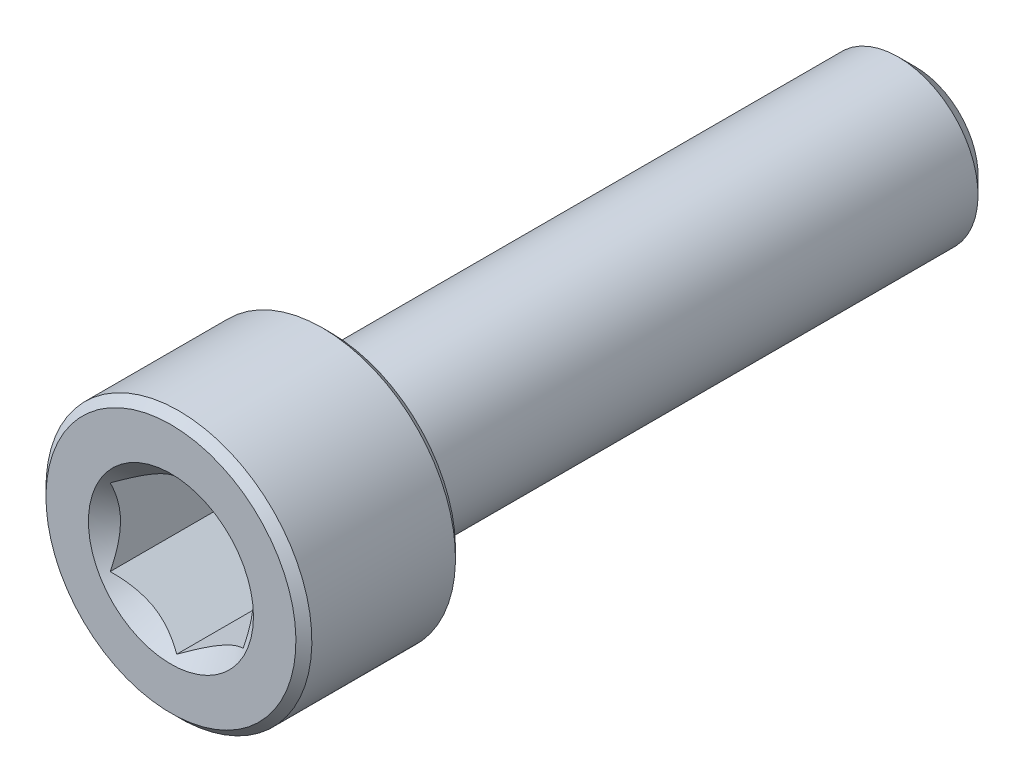
ISO-10303-21;
HEADER;
FILE_DESCRIPTION(('STEP AP214'),'2;1');
FILE_NAME('part.step','',(''),(''),'','','');
FILE_SCHEMA(('AUTOMOTIVE_DESIGN { 1 0 10303 214 1 1 1 1 }'));
ENDSEC;
DATA;
#1=APPLICATION_CONTEXT('core data for automotive mechanical design processes');
#2=APPLICATION_PROTOCOL_DEFINITION('international standard','automotive_design',2000,#1);
#3=PRODUCT_CONTEXT('',#1,'mechanical');
#4=PRODUCT('Part','Part','',(#3));
#5=PRODUCT_RELATED_PRODUCT_CATEGORY('part','',(#4));
#6=PRODUCT_DEFINITION_FORMATION('','',#4);
#7=PRODUCT_DEFINITION_CONTEXT('part definition',#1,'design');
#8=PRODUCT_DEFINITION('design','',#6,#7);
#9=PRODUCT_DEFINITION_SHAPE('','',#8);
#10=(LENGTH_UNIT() NAMED_UNIT(*) SI_UNIT(.MILLI.,.METRE.));
#11=(NAMED_UNIT(*) PLANE_ANGLE_UNIT() SI_UNIT($,.RADIAN.));
#12=(NAMED_UNIT(*) SI_UNIT($,.STERADIAN.) SOLID_ANGLE_UNIT());
#13=UNCERTAINTY_MEASURE_WITH_UNIT(LENGTH_MEASURE(1.E-05),#10,'distance_accuracy_value','');
#14=(GEOMETRIC_REPRESENTATION_CONTEXT(3) GLOBAL_UNCERTAINTY_ASSIGNED_CONTEXT((#13)) GLOBAL_UNIT_ASSIGNED_CONTEXT((#10,
#11,#12)) REPRESENTATION_CONTEXT('',''));
#15=CARTESIAN_POINT('',(0.,0.,0.));
#16=DIRECTION('',(0.,0.,1.));
#17=DIRECTION('',(1.,0.,0.));
#18=AXIS2_PLACEMENT_3D('',#15,#16,#17);
#19=CARTESIAN_POINT('',(0.,2.35048094716167,-14.));
#20=DIRECTION('',(0.,0.,-1.));
#21=DIRECTION('',(0.,1.,0.));
#22=AXIS2_PLACEMENT_3D('',#19,#20,#21);
#23=PLANE('',#22);
#24=CARTESIAN_POINT('',(0.,0.,-14.));
#25=DIRECTION('',(0.,0.,-1.));
#26=DIRECTION('',(0.,1.,0.));
#27=AXIS2_PLACEMENT_3D('',#24,#25,#26);
#28=CIRCLE('',#27,2.35048094716167);
#29=CARTESIAN_POINT('',(0.,2.35048094716167,-14.));
#30=VERTEX_POINT('',#29);
#31=EDGE_CURVE('E57',#30,#30,#28,.T.);
#32=ORIENTED_EDGE('',*,*,#31,.T.);
#33=EDGE_LOOP('',(#32));
#34=FACE_BOUND('',#33,.T.);
#35=ADVANCED_FACE('F43',(#34),#23,.T.);
#36=CARTESIAN_POINT('',(0.,0.,-14.));
#37=DIRECTION('',(0.,0.,1.));
#38=DIRECTION('',(0.,-1.,0.));
#39=AXIS2_PLACEMENT_3D('',#36,#37,#38);
#40=CONICAL_SURFACE('',#39,2.35048094716167,0.785398163397445);
#41=CARTESIAN_POINT('',(0.,0.,-13.3504809471617));
#42=DIRECTION('',(0.,0.,-1.));
#43=DIRECTION('',(0.,1.,0.));
#44=AXIS2_PLACEMENT_3D('',#41,#42,#43);
#45=CIRCLE('',#44,3.);
#46=CARTESIAN_POINT('',(0.,3.,-13.3504809471617));
#47=VERTEX_POINT('',#46);
#48=EDGE_CURVE('E175',#47,#47,#45,.T.);
#49=ORIENTED_EDGE('',*,*,#48,.T.);
#50=EDGE_LOOP('',(#49));
#51=FACE_BOUND('',#50,.T.);
#52=ORIENTED_EDGE('',*,*,#31,.F.);
#53=EDGE_LOOP('',(#52));
#54=FACE_BOUND('',#53,.T.);
#55=ADVANCED_FACE('F183',(#51,#54),#40,.T.);
#56=CARTESIAN_POINT('',(0.,0.,-14.));
#57=DIRECTION('',(0.,0.,-1.));
#58=DIRECTION('',(0.,1.,0.));
#59=AXIS2_PLACEMENT_3D('',#56,#57,#58);
#60=CYLINDRICAL_SURFACE('',#59,3.);
#61=CARTESIAN_POINT('',(0.,0.,7.7));
#62=DIRECTION('',(0.,0.,-1.));
#63=DIRECTION('',(0.,1.,0.));
#64=AXIS2_PLACEMENT_3D('',#61,#62,#63);
#65=CIRCLE('',#64,3.);
#66=CARTESIAN_POINT('',(0.,3.,7.7));
#67=VERTEX_POINT('',#66);
#68=EDGE_CURVE('E171',#67,#67,#65,.T.);
#69=ORIENTED_EDGE('',*,*,#68,.T.);
#70=EDGE_LOOP('',(#69));
#71=FACE_BOUND('',#70,.T.);
#72=ORIENTED_EDGE('',*,*,#48,.F.);
#73=EDGE_LOOP('',(#72));
#74=FACE_BOUND('',#73,.T.);
#75=ADVANCED_FACE('F185',(#71,#74),#60,.T.);
#76=CARTESIAN_POINT('',(0.,0.,7.7));
#77=DIRECTION('',(0.,0.,-1.));
#78=DIRECTION('',(0.,1.,0.));
#79=AXIS2_PLACEMENT_3D('',#76,#77,#78);
#80=TOROIDAL_SURFACE('',#79,3.3,0.3);
#81=CARTESIAN_POINT('',(0.,0.,8.));
#82=DIRECTION('',(0.,0.,-1.));
#83=DIRECTION('',(0.,1.,0.));
#84=AXIS2_PLACEMENT_3D('',#81,#82,#83);
#85=CIRCLE('',#84,3.3);
#86=CARTESIAN_POINT('',(0.,3.3,8.));
#87=VERTEX_POINT('',#86);
#88=EDGE_CURVE('E167',#87,#87,#85,.T.);
#89=ORIENTED_EDGE('',*,*,#88,.T.);
#90=EDGE_LOOP('',(#89));
#91=FACE_BOUND('',#90,.T.);
#92=ORIENTED_EDGE('',*,*,#68,.F.);
#93=EDGE_LOOP('',(#92));
#94=FACE_BOUND('',#93,.T.);
#95=ADVANCED_FACE('F191',(#91,#94),#80,.F.);
#96=CARTESIAN_POINT('',(0.,4.7,8.));
#97=DIRECTION('',(0.,0.,-1.));
#98=DIRECTION('',(0.,1.,0.));
#99=AXIS2_PLACEMENT_3D('',#96,#97,#98);
#100=PLANE('',#99);
#101=CARTESIAN_POINT('',(0.,0.,8.));
#102=DIRECTION('',(0.,0.,-1.));
#103=DIRECTION('',(0.,1.,0.));
#104=AXIS2_PLACEMENT_3D('',#101,#102,#103);
#105=CIRCLE('',#104,4.7);
#106=CARTESIAN_POINT('',(0.,4.7,8.));
#107=VERTEX_POINT('',#106);
#108=EDGE_CURVE('E163',#107,#107,#105,.T.);
#109=ORIENTED_EDGE('',*,*,#108,.T.);
#110=EDGE_LOOP('',(#109));
#111=FACE_BOUND('',#110,.T.);
#112=ORIENTED_EDGE('',*,*,#88,.F.);
#113=EDGE_LOOP('',(#112));
#114=FACE_BOUND('',#113,.T.);
#115=ADVANCED_FACE('F197',(#111,#114),#100,.T.);
#116=CARTESIAN_POINT('',(0.,0.,8.));
#117=DIRECTION('',(0.,0.,1.));
#118=DIRECTION('',(0.,-1.,0.));
#119=AXIS2_PLACEMENT_3D('',#116,#117,#118);
#120=CONICAL_SURFACE('',#119,4.7,0.785398163397445);
#121=CARTESIAN_POINT('',(0.,0.,8.3));
#122=DIRECTION('',(0.,0.,-1.));
#123=DIRECTION('',(0.,1.,0.));
#124=AXIS2_PLACEMENT_3D('',#121,#122,#123);
#125=CIRCLE('',#124,5.);
#126=CARTESIAN_POINT('',(0.,5.,8.3));
#127=VERTEX_POINT('',#126);
#128=EDGE_CURVE('E159',#127,#127,#125,.T.);
#129=ORIENTED_EDGE('',*,*,#128,.T.);
#130=EDGE_LOOP('',(#129));
#131=FACE_BOUND('',#130,.T.);
#132=ORIENTED_EDGE('',*,*,#108,.F.);
#133=EDGE_LOOP('',(#132));
#134=FACE_BOUND('',#133,.T.);
#135=ADVANCED_FACE('F201',(#131,#134),#120,.T.);
#136=CARTESIAN_POINT('',(0.,0.,-14.));
#137=DIRECTION('',(0.,0.,-1.));
#138=DIRECTION('',(0.,1.,0.));
#139=AXIS2_PLACEMENT_3D('',#136,#137,#138);
#140=CYLINDRICAL_SURFACE('',#139,5.);
#141=CARTESIAN_POINT('',(0.,0.,13.7));
#142=DIRECTION('',(0.,0.,-1.));
#143=DIRECTION('',(0.,1.,0.));
#144=AXIS2_PLACEMENT_3D('',#141,#142,#143);
#145=CIRCLE('',#144,5.);
#146=CARTESIAN_POINT('',(0.,5.,13.7));
#147=VERTEX_POINT('',#146);
#148=EDGE_CURVE('E155',#147,#147,#145,.T.);
#149=ORIENTED_EDGE('',*,*,#148,.T.);
#150=EDGE_LOOP('',(#149));
#151=FACE_BOUND('',#150,.T.);
#152=ORIENTED_EDGE('',*,*,#128,.F.);
#153=EDGE_LOOP('',(#152));
#154=FACE_BOUND('',#153,.T.);
#155=ADVANCED_FACE('F205',(#151,#154),#140,.T.);
#156=CARTESIAN_POINT('',(0.,0.,13.7));
#157=DIRECTION('',(0.,0.,-1.));
#158=DIRECTION('',(0.,1.,0.));
#159=AXIS2_PLACEMENT_3D('',#156,#157,#158);
#160=CONICAL_SURFACE('',#159,5.,0.785398163397451);
#161=CARTESIAN_POINT('',(0.,0.,14.));
#162=DIRECTION('',(0.,0.,-1.));
#163=DIRECTION('',(0.,1.,0.));
#164=AXIS2_PLACEMENT_3D('',#161,#162,#163);
#165=CIRCLE('',#164,4.7);
#166=CARTESIAN_POINT('',(0.,4.7,14.));
#167=VERTEX_POINT('',#166);
#168=EDGE_CURVE('E151',#167,#167,#165,.T.);
#169=ORIENTED_EDGE('',*,*,#168,.T.);
#170=EDGE_LOOP('',(#169));
#171=FACE_BOUND('',#170,.T.);
#172=ORIENTED_EDGE('',*,*,#148,.F.);
#173=EDGE_LOOP('',(#172));
#174=FACE_BOUND('',#173,.T.);
#175=ADVANCED_FACE('F209',(#171,#174),#160,.T.);
#176=CARTESIAN_POINT('',(0.,0.,14.));
#177=DIRECTION('',(0.,0.,1.));
#178=DIRECTION('',(0.,-1.,0.));
#179=AXIS2_PLACEMENT_3D('',#176,#177,#178);
#180=PLANE('',#179);
#181=CARTESIAN_POINT('',(0.,0.,14.));
#182=DIRECTION('',(0.,0.,1.));
#183=DIRECTION('',(1.,0.,0.));
#184=AXIS2_PLACEMENT_3D('',#181,#182,#183);
#185=CIRCLE('',#184,3.10325769689424);
#186=CARTESIAN_POINT('',(3.10325769689424,0.,14.));
#187=VERTEX_POINT('',#186);
#188=EDGE_CURVE('E117',#187,#187,#185,.T.);
#189=ORIENTED_EDGE('',*,*,#188,.F.);
#190=EDGE_LOOP('',(#189));
#191=FACE_BOUND('',#190,.T.);
#192=ORIENTED_EDGE('',*,*,#168,.F.);
#193=EDGE_LOOP('',(#192));
#194=FACE_BOUND('',#193,.T.);
#195=ADVANCED_FACE('F213',(#191,#194),#180,.T.);
#196=CARTESIAN_POINT('',(0.,0.,14.));
#197=DIRECTION('',(0.,0.,1.));
#198=DIRECTION('',(1.,0.,0.));
#199=AXIS2_PLACEMENT_3D('',#196,#197,#198);
#200=CONICAL_SURFACE('',#199,3.10325769689424,0.78539816339745);
#201=ORIENTED_EDGE('',*,*,#188,.T.);
#202=EDGE_LOOP('',(#201));
#203=FACE_BOUND('',#202,.T.);
#204=CARTESIAN_POINT('',(-0.000199999999999129,-2.88686681600197,13.7836091260357));
#205=CARTESIAN_POINT('',(0.0857382777877655,-2.83725032818751,13.7340343544086));
#206=CARTESIAN_POINT('',(0.173113567275754,-2.7868041812811,13.6873711304164));
#207=CARTESIAN_POINT('',(0.351281456165589,-2.6839389026696,13.6019317890922));
#208=CARTESIAN_POINT('',(0.442091000681076,-2.6315099876986,13.5632032114599));
#209=CARTESIAN_POINT('',(0.625204123126922,-2.52578957716234,13.4968603529516));
#210=CARTESIAN_POINT('',(0.717461064529342,-2.47252500720904,13.4690793175847));
#211=CARTESIAN_POINT('',(0.904006008776288,-2.3648232334321,13.4262768249646));
#212=CARTESIAN_POINT('',(0.998288312566285,-2.31038931995913,13.4112234157252));
#213=CARTESIAN_POINT('',(1.16077825829185,-2.21657570605387,13.3976413712634));
#214=CARTESIAN_POINT('',(1.22877596788015,-2.17731721011878,13.3956307482947));
#215=CARTESIAN_POINT('',(1.36466024116922,-2.0988643883567,13.3990177662414));
#216=CARTESIAN_POINT('',(1.43254675755224,-2.05967008984862,13.4044180043537));
#217=CARTESIAN_POINT('',(1.56767878823611,-1.98165157555715,13.4223194374564));
#218=CARTESIAN_POINT('',(1.63492349975356,-1.94282782326097,13.4348285761004));
#219=CARTESIAN_POINT('',(1.7682501008182,-1.86585167424616,13.4662611510096));
#220=CARTESIAN_POINT('',(1.83433207909966,-1.82769922629678,13.4851840955507));
#221=CARTESIAN_POINT('',(2.00359634669127,-1.72997445583858,13.5413610104621));
#222=CARTESIAN_POINT('',(2.10572912222289,-1.67100807039231,13.5828494806501));
#223=CARTESIAN_POINT('',(2.25590641494051,-1.58430317001562,13.652887695777));
#224=CARTESIAN_POINT('',(2.30539653988261,-1.55573003305807,13.67749590117));
#225=CARTESIAN_POINT('',(2.40346006383885,-1.49911303110426,13.7289555357691));
#226=CARTESIAN_POINT('',(2.45203400349693,-1.47106885396706,13.7558055878332));
#227=CARTESIAN_POINT('',(2.5002,-1.44326020292023,13.7836091260357));
#228=B_SPLINE_CURVE_WITH_KNOTS('',3,(#204,#205,#206,#207,#208,#209,#210,#211,#212,#213,#214,
#215,#216,#217,#218,#219,#220,#221,#222,#223,#224,#225,#226,#227),.UNSPECIFIED.,.F.,.F.,(4,2,2,
2,2,2,2,2,2,2,2,4),(0.,0.333012085133924,0.667964518301397,0.997597032043301,1.32639954393844,
1.56169424147169,1.79707142102083,2.03271213522171,2.26833478775651,2.64260240809533,
2.82922877818864,3.01574133749025),.UNSPECIFIED.);
#229=CARTESIAN_POINT('',(0.,-2.88675134594813,13.7834936490539));
#230=VERTEX_POINT('',#229);
#231=CARTESIAN_POINT('',(2.5,-1.44337567297406,13.7834936490539));
#232=VERTEX_POINT('',#231);
#233=EDGE_CURVE('E12',#230,#232,#228,.T.);
#234=ORIENTED_EDGE('',*,*,#233,.F.);
#235=CARTESIAN_POINT('',(-2.5002,-1.44326020292023,13.7836091260357));
#236=CARTESIAN_POINT('',(-2.41426172221224,-1.49287669073469,13.7340343544086));
#237=CARTESIAN_POINT('',(-2.32688643272425,-1.5433228376411,13.6873711304164));
#238=CARTESIAN_POINT('',(-2.14871854383441,-1.64618811625259,13.6019317890922));
#239=CARTESIAN_POINT('',(-2.05790899931893,-1.69861703122359,13.5632032114599));
#240=CARTESIAN_POINT('',(-1.87479587687308,-1.80433744175986,13.4968603529516));
#241=CARTESIAN_POINT('',(-1.78253893547066,-1.85760201171315,13.4690793175847));
#242=CARTESIAN_POINT('',(-1.59599399122372,-1.96530378549009,13.4262768249646));
#243=CARTESIAN_POINT('',(-1.50171168743372,-2.01973769896307,13.4112234157252));
#244=CARTESIAN_POINT('',(-1.33922174170816,-2.11355131286833,13.3976413712634));
#245=CARTESIAN_POINT('',(-1.27122403211985,-2.15280980880341,13.3956307482947));
#246=CARTESIAN_POINT('',(-1.13533975883078,-2.23126263056549,13.3990177662414));
#247=CARTESIAN_POINT('',(-1.06745324244776,-2.27045692907358,13.4044180043537));
#248=CARTESIAN_POINT('',(-0.932321211763895,-2.34847544336505,13.4223194374564));
#249=CARTESIAN_POINT('',(-0.865076500246441,-2.38729919566123,13.4348285761004));
#250=CARTESIAN_POINT('',(-0.731749899181802,-2.46427534467604,13.4662611510096));
#251=CARTESIAN_POINT('',(-0.665667920900344,-2.50242779262542,13.4851840955507));
#252=CARTESIAN_POINT('',(-0.496403653308736,-2.60015256308362,13.5413610104621));
#253=CARTESIAN_POINT('',(-0.394270877777107,-2.65911894852989,13.5828494806501));
#254=CARTESIAN_POINT('',(-0.244093585059491,-2.74582384890657,13.652887695777));
#255=CARTESIAN_POINT('',(-0.194603460117391,-2.77439698586412,13.67749590117));
#256=CARTESIAN_POINT('',(-0.0965399361611526,-2.83101398781794,13.7289555357691));
#257=CARTESIAN_POINT('',(-0.0479659965030713,-2.85905816495513,13.7558055878332));
#258=CARTESIAN_POINT('',(0.000200000000000756,-2.88686681600197,13.7836091260357));
#259=B_SPLINE_CURVE_WITH_KNOTS('',3,(#235,#236,#237,#238,#239,#240,#241,#242,#243,#244,#245,
#246,#247,#248,#249,#250,#251,#252,#253,#254,#255,#256,#257,#258),.UNSPECIFIED.,.F.,.F.,(4,2,2,
2,2,2,2,2,2,2,2,4),(0.,0.333012085133923,0.667964518301396,0.997597032043298,1.32639954393844,
1.56169424147169,1.79707142102083,2.03271213522171,2.26833478775651,2.64260240809533,
2.82922877818864,3.01574133749025),.UNSPECIFIED.);
#260=CARTESIAN_POINT('',(-2.5,-1.44337567297407,13.7834936490539));
#261=VERTEX_POINT('',#260);
#262=EDGE_CURVE('E102',#261,#230,#259,.T.);
#263=ORIENTED_EDGE('',*,*,#262,.F.);
#264=CARTESIAN_POINT('',(-2.5,-3.0404429247869,14.8330214063817));
#265=CARTESIAN_POINT('',(-2.5,-2.96709478172557,14.7763788487171));
#266=CARTESIAN_POINT('',(-2.5,-2.89335465135762,14.7202359693275));
#267=CARTESIAN_POINT('',(-2.5,-2.74492905640712,14.6091787819783));
#268=CARTESIAN_POINT('',(-2.5,-2.67024337493575,14.5542647641906));
#269=CARTESIAN_POINT('',(-2.5,-2.51921990828825,14.4455038420407));
#270=CARTESIAN_POINT('',(-2.5,-2.44287382770906,14.391668419147));
#271=CARTESIAN_POINT('',(-2.5,-2.28891665120372,14.2858441602624));
#272=CARTESIAN_POINT('',(-2.5,-2.21130564250585,14.2338551977207));
#273=CARTESIAN_POINT('',(-2.5,-2.04951799142744,14.1288457042913));
#274=CARTESIAN_POINT('',(-2.5,-1.96524215656549,14.0759772332794));
#275=CARTESIAN_POINT('',(-2.5,-1.79473490703969,13.9734987026906));
#276=CARTESIAN_POINT('',(-2.5,-1.70850374831487,13.9238882199388));
#277=CARTESIAN_POINT('',(-2.5,-1.53401833929875,13.8289545270337));
#278=CARTESIAN_POINT('',(-2.5,-1.44577065756376,13.7836193384592));
#279=CARTESIAN_POINT('',(-2.5,-1.26676310994808,13.6982604224777));
#280=CARTESIAN_POINT('',(-2.5,-1.17600446376454,13.658234169168));
#281=CARTESIAN_POINT('',(-2.5,-1.00118351570532,13.5886962875671));
#282=CARTESIAN_POINT('',(-2.5,-0.917385051629537,13.5585280842829));
#283=CARTESIAN_POINT('',(-2.5,-0.747629060099932,13.5048969377877));
#284=CARTESIAN_POINT('',(-2.5,-0.661671397551605,13.4814344152734));
#285=CARTESIAN_POINT('',(-2.5,-0.489622081200868,13.4428857605003));
#286=CARTESIAN_POINT('',(-2.5,-0.40356552129825,13.4276456482725));
#287=CARTESIAN_POINT('',(-2.5,-0.230352389629818,13.4058639492467));
#288=CARTESIAN_POINT('',(-2.5,-0.143196059113861,13.3993204870893));
#289=CARTESIAN_POINT('',(-2.5,0.0273612295446632,13.395504167584));
#290=CARTESIAN_POINT('',(-2.5,0.110753131974797,13.3978241071313));
#291=CARTESIAN_POINT('',(-2.5,0.276898134935754,13.4106653349727));
#292=CARTESIAN_POINT('',(-2.5,0.359651177707743,13.421187356241));
#293=CARTESIAN_POINT('',(-2.5,0.525325927795181,13.4500114990314));
#294=CARTESIAN_POINT('',(-2.5,0.608223175291063,13.4684520406654));
#295=CARTESIAN_POINT('',(-2.5,0.772178834557464,13.5120846864152));
#296=CARTESIAN_POINT('',(-2.5,0.853237339741925,13.5372764467107));
#297=CARTESIAN_POINT('',(-2.5,1.10159689599554,13.6241193926927));
#298=CARTESIAN_POINT('',(-2.5,1.2655525401235,13.6953668377804));
#299=CARTESIAN_POINT('',(-2.5,1.50551769780196,13.8142345481021));
#300=CARTESIAN_POINT('',(-2.5,1.58465788064155,13.8559484521643));
#301=CARTESIAN_POINT('',(-2.5,1.74114816885994,13.9426161601922));
#302=CARTESIAN_POINT('',(-2.5,1.81849858456147,13.9875693968529));
#303=CARTESIAN_POINT('',(-2.5,1.96784059769267,14.0777853522682));
#304=CARTESIAN_POINT('',(-2.5,2.03990833441822,14.1229234485208));
#305=CARTESIAN_POINT('',(-2.5,2.18280709640722,14.2151257428437));
#306=CARTESIAN_POINT('',(-2.5,2.2536380285734,14.2621900850232));
#307=CARTESIAN_POINT('',(-2.5,2.39365462675841,14.3575181428367));
#308=CARTESIAN_POINT('',(-2.5,2.46284892785043,14.405769227967));
#309=CARTESIAN_POINT('',(-2.5,2.60028772768959,14.5035675953205));
#310=CARTESIAN_POINT('',(-2.5,2.66853248306037,14.5531145164816));
#311=CARTESIAN_POINT('',(-2.5,2.73637900498552,14.6031920948776));
#312=B_SPLINE_CURVE_WITH_KNOTS('',3,(#264,#265,#266,#267,#268,#269,#270,#271,#272,#273,#274,
#275,#276,#277,#278,#279,#280,#281,#282,#283,#284,#285,#286,#287,#288,#289,#290,#291,#292,#293,
#294,#295,#296,#297,#298,#299,#300,#301,#302,#303,#304,#305,#306,#307,#308,#309,#310,#311),
.UNSPECIFIED.,.F.,.F.,(4,2,2,2,2,2,2,2,2,2,2,2,2,2,2,2,2,2,2,2,2,2,2,4),(0.,0.278024739230087,
0.556114450273834,0.836346737531472,1.11655978131476,1.41496015304213,1.71332168905073,
2.01082076966666,2.30817779353377,2.57513879386764,2.84211653895115,3.10390388797607,
3.36563477559628,3.61548897009284,3.86536549522731,4.11980016461986,4.37422187884309,
4.90887010890445,5.17722912654037,5.44554126009378,5.70061957252692,5.95571700326383,
6.20877059828287,6.46175442014512),.UNSPECIFIED.);
#313=CARTESIAN_POINT('',(-2.5,1.44337567297406,13.7834936490539));
#314=VERTEX_POINT('',#313);
#315=EDGE_CURVE('E116',#314,#261,#312,.F.);
#316=ORIENTED_EDGE('',*,*,#315,.F.);
#317=CARTESIAN_POINT('',(0.000199999999999144,2.88686681600197,13.7836091260357));
#318=CARTESIAN_POINT('',(-0.0857382777877656,2.83725032818751,13.7340343544086));
#319=CARTESIAN_POINT('',(-0.173113567275754,2.7868041812811,13.6873711304164));
#320=CARTESIAN_POINT('',(-0.351281456165589,2.6839389026696,13.6019317890922));
#321=CARTESIAN_POINT('',(-0.442091000681075,2.6315099876986,13.5632032114599));
#322=CARTESIAN_POINT('',(-0.625204123126922,2.52578957716234,13.4968603529516));
#323=CARTESIAN_POINT('',(-0.717461064529341,2.47252500720904,13.4690793175847));
#324=CARTESIAN_POINT('',(-0.904006008776287,2.3648232334321,13.4262768249646));
#325=CARTESIAN_POINT('',(-0.998288312566284,2.31038931995913,13.4112234157252));
#326=CARTESIAN_POINT('',(-1.16077825829185,2.21657570605387,13.3976413712634));
#327=CARTESIAN_POINT('',(-1.22877596788015,2.17731721011878,13.3956307482947));
#328=CARTESIAN_POINT('',(-1.36466024116922,2.0988643883567,13.3990177662414));
#329=CARTESIAN_POINT('',(-1.43254675755224,2.05967008984862,13.4044180043537));
#330=CARTESIAN_POINT('',(-1.56767878823611,1.98165157555715,13.4223194374564));
#331=CARTESIAN_POINT('',(-1.63492349975356,1.94282782326096,13.4348285761004));
#332=CARTESIAN_POINT('',(-1.7682501008182,1.86585167424616,13.4662611510096));
#333=CARTESIAN_POINT('',(-1.83433207909966,1.82769922629677,13.4851840955507));
#334=CARTESIAN_POINT('',(-2.00359634669127,1.72997445583858,13.5413610104621));
#335=CARTESIAN_POINT('',(-2.10572912222289,1.67100807039231,13.5828494806501));
#336=CARTESIAN_POINT('',(-2.25590641494051,1.58430317001562,13.652887695777));
#337=CARTESIAN_POINT('',(-2.30539653988261,1.55573003305807,13.67749590117));
#338=CARTESIAN_POINT('',(-2.40346006383885,1.49911303110425,13.7289555357691));
#339=CARTESIAN_POINT('',(-2.45203400349693,1.47106885396706,13.7558055878332));
#340=CARTESIAN_POINT('',(-2.5002,1.44326020292023,13.7836091260357));
#341=B_SPLINE_CURVE_WITH_KNOTS('',3,(#317,#318,#319,#320,#321,#322,#323,#324,#325,#326,#327,
#328,#329,#330,#331,#332,#333,#334,#335,#336,#337,#338,#339,#340),.UNSPECIFIED.,.F.,.F.,(4,2,2,
2,2,2,2,2,2,2,2,4),(0.,0.333012085133924,0.667964518301397,0.997597032043299,1.32639954393844,
1.56169424147169,1.79707142102083,2.03271213522171,2.26833478775651,2.64260240809533,
2.82922877818864,3.01574133749025),.UNSPECIFIED.);
#342=CARTESIAN_POINT('',(0.,2.88675134594813,13.7834936490539));
#343=VERTEX_POINT('',#342);
#344=EDGE_CURVE('E264',#343,#314,#341,.T.);
#345=ORIENTED_EDGE('',*,*,#344,.F.);
#346=CARTESIAN_POINT('',(2.5002,1.44326020292023,13.7836091260357));
#347=CARTESIAN_POINT('',(2.41426172221224,1.49287669073469,13.7340343544086));
#348=CARTESIAN_POINT('',(2.32688643272425,1.5433228376411,13.6873711304164));
#349=CARTESIAN_POINT('',(2.14871854383441,1.64618811625259,13.6019317890922));
#350=CARTESIAN_POINT('',(2.05790899931893,1.69861703122359,13.5632032114599));
#351=CARTESIAN_POINT('',(1.87479587687308,1.80433744175986,13.4968603529516));
#352=CARTESIAN_POINT('',(1.78253893547066,1.85760201171315,13.4690793175847));
#353=CARTESIAN_POINT('',(1.59599399122371,1.96530378549009,13.4262768249646));
#354=CARTESIAN_POINT('',(1.50171168743372,2.01973769896307,13.4112234157252));
#355=CARTESIAN_POINT('',(1.33922174170815,2.11355131286833,13.3976413712634));
#356=CARTESIAN_POINT('',(1.27122403211985,2.15280980880341,13.3956307482947));
#357=CARTESIAN_POINT('',(1.13533975883078,2.23126263056549,13.3990177662414));
#358=CARTESIAN_POINT('',(1.06745324244776,2.27045692907357,13.4044180043537));
#359=CARTESIAN_POINT('',(0.932321211763894,2.34847544336505,13.4223194374564));
#360=CARTESIAN_POINT('',(0.86507650024644,2.38729919566123,13.4348285761004));
#361=CARTESIAN_POINT('',(0.731749899181801,2.46427534467603,13.4662611510096));
#362=CARTESIAN_POINT('',(0.665667920900343,2.50242779262542,13.4851840955507));
#363=CARTESIAN_POINT('',(0.496403653308736,2.60015256308362,13.5413610104621));
#364=CARTESIAN_POINT('',(0.394270877777108,2.65911894852989,13.5828494806501));
#365=CARTESIAN_POINT('',(0.244093585059491,2.74582384890657,13.652887695777));
#366=CARTESIAN_POINT('',(0.19460346011739,2.77439698586412,13.67749590117));
#367=CARTESIAN_POINT('',(0.0965399361611525,2.83101398781794,13.7289555357691));
#368=CARTESIAN_POINT('',(0.0479659965030713,2.85905816495513,13.7558055878332));
#369=CARTESIAN_POINT('',(-0.00020000000000088,2.88686681600197,13.7836091260357));
#370=B_SPLINE_CURVE_WITH_KNOTS('',3,(#346,#347,#348,#349,#350,#351,#352,#353,#354,#355,#356,
#357,#358,#359,#360,#361,#362,#363,#364,#365,#366,#367,#368,#369),.UNSPECIFIED.,.F.,.F.,(4,2,2,
2,2,2,2,2,2,2,2,4),(0.,0.333012085133925,0.667964518301397,0.997597032043299,1.32639954393844,
1.56169424147169,1.79707142102083,2.03271213522171,2.26833478775651,2.64260240809533,
2.82922877818864,3.01574133749025),.UNSPECIFIED.);
#371=CARTESIAN_POINT('',(2.5,1.44337567297406,13.7834936490539));
#372=VERTEX_POINT('',#371);
#373=EDGE_CURVE('E237',#372,#343,#370,.T.);
#374=ORIENTED_EDGE('',*,*,#373,.F.);
#375=CARTESIAN_POINT('',(2.5,-3.0404429247869,14.8330214063817));
#376=CARTESIAN_POINT('',(2.5,-2.96709478172557,14.7763788487171));
#377=CARTESIAN_POINT('',(2.5,-2.89335465135762,14.7202359693275));
#378=CARTESIAN_POINT('',(2.5,-2.74492905640712,14.6091787819783));
#379=CARTESIAN_POINT('',(2.5,-2.67024337493575,14.5542647641906));
#380=CARTESIAN_POINT('',(2.5,-2.51921990828824,14.4455038420407));
#381=CARTESIAN_POINT('',(2.5,-2.44287382770905,14.391668419147));
#382=CARTESIAN_POINT('',(2.5,-2.28891665120372,14.2858441602624));
#383=CARTESIAN_POINT('',(2.5,-2.21130564250584,14.2338551977207));
#384=CARTESIAN_POINT('',(2.5,-2.04951799142744,14.1288457042913));
#385=CARTESIAN_POINT('',(2.5,-1.96524215656549,14.0759772332794));
#386=CARTESIAN_POINT('',(2.5,-1.79473490703968,13.9734987026906));
#387=CARTESIAN_POINT('',(2.5,-1.70850374831487,13.9238882199388));
#388=CARTESIAN_POINT('',(2.5,-1.53401833929875,13.8289545270337));
#389=CARTESIAN_POINT('',(2.5,-1.44577065756376,13.7836193384592));
#390=CARTESIAN_POINT('',(2.5,-1.26676310994809,13.6982604224777));
#391=CARTESIAN_POINT('',(2.5,-1.17600446376454,13.658234169168));
#392=CARTESIAN_POINT('',(2.5,-1.00118351570532,13.5886962875671));
#393=CARTESIAN_POINT('',(2.5,-0.917385051629537,13.5585280842829));
#394=CARTESIAN_POINT('',(2.5,-0.747629060099932,13.5048969377877));
#395=CARTESIAN_POINT('',(2.5,-0.661671397551605,13.4814344152734));
#396=CARTESIAN_POINT('',(2.5,-0.489622081200868,13.4428857605003));
#397=CARTESIAN_POINT('',(2.5,-0.40356552129825,13.4276456482725));
#398=CARTESIAN_POINT('',(2.5,-0.230352389629818,13.4058639492467));
#399=CARTESIAN_POINT('',(2.5,-0.143196059113861,13.3993204870893));
#400=CARTESIAN_POINT('',(2.5,0.0273612295446629,13.395504167584));
#401=CARTESIAN_POINT('',(2.5,0.110753131974797,13.3978241071313));
#402=CARTESIAN_POINT('',(2.5,0.276898134935754,13.4106653349727));
#403=CARTESIAN_POINT('',(2.5,0.359651177707742,13.421187356241));
#404=CARTESIAN_POINT('',(2.5,0.525325927795181,13.4500114990314));
#405=CARTESIAN_POINT('',(2.5,0.608223175291063,13.4684520406654));
#406=CARTESIAN_POINT('',(2.5,0.772178834557464,13.5120846864152));
#407=CARTESIAN_POINT('',(2.5,0.853237339741924,13.5372764467107));
#408=CARTESIAN_POINT('',(2.5,1.10159689599554,13.6241193926927));
#409=CARTESIAN_POINT('',(2.5,1.2655525401235,13.6953668377804));
#410=CARTESIAN_POINT('',(2.5,1.50551769780196,13.8142345481021));
#411=CARTESIAN_POINT('',(2.5,1.58465788064155,13.8559484521643));
#412=CARTESIAN_POINT('',(2.5,1.74114816885994,13.9426161601922));
#413=CARTESIAN_POINT('',(2.5,1.81849858456147,13.9875693968529));
#414=CARTESIAN_POINT('',(2.5,1.96784059769267,14.0777853522682));
#415=CARTESIAN_POINT('',(2.5,2.03990833441822,14.1229234485208));
#416=CARTESIAN_POINT('',(2.5,2.18280709640722,14.2151257428437));
#417=CARTESIAN_POINT('',(2.5,2.2536380285734,14.2621900850232));
#418=CARTESIAN_POINT('',(2.5,2.39365462675841,14.3575181428367));
#419=CARTESIAN_POINT('',(2.5,2.46284892785043,14.405769227967));
#420=CARTESIAN_POINT('',(2.5,2.60028772768959,14.5035675953205));
#421=CARTESIAN_POINT('',(2.5,2.66853248306037,14.5531145164816));
#422=CARTESIAN_POINT('',(2.5,2.73637900498552,14.6031920948776));
#423=B_SPLINE_CURVE_WITH_KNOTS('',3,(#375,#376,#377,#378,#379,#380,#381,#382,#383,#384,#385,
#386,#387,#388,#389,#390,#391,#392,#393,#394,#395,#396,#397,#398,#399,#400,#401,#402,#403,#404,
#405,#406,#407,#408,#409,#410,#411,#412,#413,#414,#415,#416,#417,#418,#419,#420,#421,#422),
.UNSPECIFIED.,.F.,.F.,(4,2,2,2,2,2,2,2,2,2,2,2,2,2,2,2,2,2,2,2,2,2,2,4),(0.,0.278024739230087,
0.556114450273837,0.836346737531475,1.11655978131476,1.41496015304214,1.71332168905073,
2.01082076966666,2.30817779353377,2.57513879386764,2.84211653895115,3.10390388797607,
3.36563477559628,3.61548897009284,3.86536549522731,4.11980016461986,4.37422187884309,
4.90887010890445,5.17722912654037,5.44554126009378,5.70061957252692,5.95571700326383,
6.20877059828287,6.46175442014512),.UNSPECIFIED.);
#424=EDGE_CURVE('E64',#232,#372,#423,.T.);
#425=ORIENTED_EDGE('',*,*,#424,.F.);
#426=EDGE_LOOP('',(#234,#263,#316,#345,#374,#425));
#427=FACE_BOUND('',#426,.T.);
#428=ADVANCED_FACE('F101',(#203,#427),#200,.F.);
#429=CARTESIAN_POINT('',(0.,4.7,9.));
#430=DIRECTION('',(0.,0.,-1.));
#431=DIRECTION('',(0.,1.,0.));
#432=AXIS2_PLACEMENT_3D('',#429,#430,#431);
#433=PLANE('',#432);
#434=DIRECTION('',(0.866025403784438,0.5,0.));
#435=VECTOR('',#434,1.);
#436=CARTESIAN_POINT('',(0.,-2.88675134594813,9.));
#437=LINE('',#436,#435);
#438=CARTESIAN_POINT('',(0.,-2.88675134594813,9.));
#439=VERTEX_POINT('',#438);
#440=CARTESIAN_POINT('',(2.5,-1.44337567297406,9.));
#441=VERTEX_POINT('',#440);
#442=EDGE_CURVE('E120',#439,#441,#437,.T.);
#443=ORIENTED_EDGE('',*,*,#442,.T.);
#444=DIRECTION('',(0.,1.,0.));
#445=VECTOR('',#444,1.);
#446=CARTESIAN_POINT('',(2.5,-1.44337567297406,9.));
#447=LINE('',#446,#445);
#448=CARTESIAN_POINT('',(2.5,1.44337567297406,9.));
#449=VERTEX_POINT('',#448);
#450=EDGE_CURVE('E71',#441,#449,#447,.T.);
#451=ORIENTED_EDGE('',*,*,#450,.T.);
#452=DIRECTION('',(-0.866025403784439,0.5,0.));
#453=VECTOR('',#452,1.);
#454=CARTESIAN_POINT('',(2.5,1.44337567297406,9.));
#455=LINE('',#454,#453);
#456=CARTESIAN_POINT('',(0.,2.88675134594813,9.));
#457=VERTEX_POINT('',#456);
#458=EDGE_CURVE('E131',#449,#457,#455,.T.);
#459=ORIENTED_EDGE('',*,*,#458,.T.);
#460=DIRECTION('',(-0.866025403784439,-0.5,0.));
#461=VECTOR('',#460,1.);
#462=CARTESIAN_POINT('',(0.,2.88675134594813,9.));
#463=LINE('',#462,#461);
#464=CARTESIAN_POINT('',(-2.5,1.44337567297406,9.));
#465=VERTEX_POINT('',#464);
#466=EDGE_CURVE('E140',#457,#465,#463,.T.);
#467=ORIENTED_EDGE('',*,*,#466,.T.);
#468=DIRECTION('',(0.,-1.,0.));
#469=VECTOR('',#468,1.);
#470=CARTESIAN_POINT('',(-2.5,1.44337567297406,9.));
#471=LINE('',#470,#469);
#472=CARTESIAN_POINT('',(-2.5,-1.44337567297406,9.));
#473=VERTEX_POINT('',#472);
#474=EDGE_CURVE('E135',#465,#473,#471,.T.);
#475=ORIENTED_EDGE('',*,*,#474,.T.);
#476=DIRECTION('',(0.866025403784439,-0.5,0.));
#477=VECTOR('',#476,1.);
#478=CARTESIAN_POINT('',(-2.5,-1.44337567297407,9.));
#479=LINE('',#478,#477);
#480=EDGE_CURVE('E122',#473,#439,#479,.T.);
#481=ORIENTED_EDGE('',*,*,#480,.T.);
#482=EDGE_LOOP('',(#443,#451,#459,#467,#475,#481));
#483=FACE_BOUND('',#482,.T.);
#484=ADVANCED_FACE('F218',(#483),#433,.F.);
#485=CARTESIAN_POINT('',(0.,-2.88675134594813,0.362373841740269));
#486=DIRECTION('',(0.5,-0.866025403784438,0.));
#487=DIRECTION('',(0.866025403784438,0.5,0.));
#488=AXIS2_PLACEMENT_3D('',#485,#486,#487);
#489=PLANE('',#488);
#490=DIRECTION('',(0.,0.,1.));
#491=VECTOR('',#490,1.);
#492=CARTESIAN_POINT('',(0.,-2.88675134594813,0.362373841740269));
#493=LINE('',#492,#491);
#494=EDGE_CURVE('E111',#439,#230,#493,.T.);
#495=ORIENTED_EDGE('',*,*,#494,.T.);
#496=ORIENTED_EDGE('',*,*,#233,.T.);
#497=DIRECTION('',(0.,0.,1.));
#498=VECTOR('',#497,1.);
#499=CARTESIAN_POINT('',(2.5,-1.44337567297406,0.362373841740269));
#500=LINE('',#499,#498);
#501=EDGE_CURVE('E126',#441,#232,#500,.T.);
#502=ORIENTED_EDGE('',*,*,#501,.F.);
#503=ORIENTED_EDGE('',*,*,#442,.F.);
#504=EDGE_LOOP('',(#495,#496,#502,#503));
#505=FACE_BOUND('',#504,.T.);
#506=ADVANCED_FACE('F119',(#505),#489,.F.);
#507=CARTESIAN_POINT('',(-2.5,-1.44337567297407,0.362373841740269));
#508=DIRECTION('',(-0.5,-0.866025403784439,0.));
#509=DIRECTION('',(0.866025403784439,-0.5,0.));
#510=AXIS2_PLACEMENT_3D('',#507,#508,#509);
#511=PLANE('',#510);
#512=DIRECTION('',(0.,0.,1.));
#513=VECTOR('',#512,1.);
#514=CARTESIAN_POINT('',(-2.5,-1.44337567297407,0.362373841740269));
#515=LINE('',#514,#513);
#516=EDGE_CURVE('E114',#473,#261,#515,.T.);
#517=ORIENTED_EDGE('',*,*,#516,.T.);
#518=ORIENTED_EDGE('',*,*,#262,.T.);
#519=ORIENTED_EDGE('',*,*,#494,.F.);
#520=ORIENTED_EDGE('',*,*,#480,.F.);
#521=EDGE_LOOP('',(#517,#518,#519,#520));
#522=FACE_BOUND('',#521,.T.);
#523=ADVANCED_FACE('F110',(#522),#511,.F.);
#524=CARTESIAN_POINT('',(-2.5,1.44337567297406,0.362373841740269));
#525=DIRECTION('',(-1.,0.,0.));
#526=DIRECTION('',(0.,0.,1.));
#527=AXIS2_PLACEMENT_3D('',#524,#525,#526);
#528=PLANE('',#527);
#529=DIRECTION('',(0.,0.,1.));
#530=VECTOR('',#529,1.);
#531=CARTESIAN_POINT('',(-2.5,1.44337567297406,0.362373841740269));
#532=LINE('',#531,#530);
#533=EDGE_CURVE('E136',#465,#314,#532,.T.);
#534=ORIENTED_EDGE('',*,*,#533,.T.);
#535=ORIENTED_EDGE('',*,*,#315,.T.);
#536=ORIENTED_EDGE('',*,*,#516,.F.);
#537=ORIENTED_EDGE('',*,*,#474,.F.);
#538=EDGE_LOOP('',(#534,#535,#536,#537));
#539=FACE_BOUND('',#538,.T.);
#540=ADVANCED_FACE('F274',(#539),#528,.F.);
#541=CARTESIAN_POINT('',(0.,2.88675134594813,0.362373841740269));
#542=DIRECTION('',(-0.5,0.866025403784438,0.));
#543=DIRECTION('',(-0.866025403784439,-0.5,0.));
#544=AXIS2_PLACEMENT_3D('',#541,#542,#543);
#545=PLANE('',#544);
#546=DIRECTION('',(0.,0.,1.));
#547=VECTOR('',#546,1.);
#548=CARTESIAN_POINT('',(0.,2.88675134594813,0.362373841740269));
#549=LINE('',#548,#547);
#550=EDGE_CURVE('E141',#457,#343,#549,.T.);
#551=ORIENTED_EDGE('',*,*,#550,.T.);
#552=ORIENTED_EDGE('',*,*,#344,.T.);
#553=ORIENTED_EDGE('',*,*,#533,.F.);
#554=ORIENTED_EDGE('',*,*,#466,.F.);
#555=EDGE_LOOP('',(#551,#552,#553,#554));
#556=FACE_BOUND('',#555,.T.);
#557=ADVANCED_FACE('F271',(#556),#545,.F.);
#558=CARTESIAN_POINT('',(2.5,1.44337567297406,0.362373841740269));
#559=DIRECTION('',(0.5,0.866025403784439,0.));
#560=DIRECTION('',(-0.866025403784439,0.5,0.));
#561=AXIS2_PLACEMENT_3D('',#558,#559,#560);
#562=PLANE('',#561);
#563=DIRECTION('',(0.,0.,1.));
#564=VECTOR('',#563,1.);
#565=CARTESIAN_POINT('',(2.5,1.44337567297406,0.362373841740269));
#566=LINE('',#565,#564);
#567=EDGE_CURVE('E145',#449,#372,#566,.T.);
#568=ORIENTED_EDGE('',*,*,#567,.T.);
#569=ORIENTED_EDGE('',*,*,#373,.T.);
#570=ORIENTED_EDGE('',*,*,#550,.F.);
#571=ORIENTED_EDGE('',*,*,#458,.F.);
#572=EDGE_LOOP('',(#568,#569,#570,#571));
#573=FACE_BOUND('',#572,.T.);
#574=ADVANCED_FACE('F226',(#573),#562,.F.);
#575=CARTESIAN_POINT('',(2.5,-1.44337567297406,0.362373841740269));
#576=DIRECTION('',(1.,0.,0.));
#577=DIRECTION('',(0.,0.,-1.));
#578=AXIS2_PLACEMENT_3D('',#575,#576,#577);
#579=PLANE('',#578);
#580=ORIENTED_EDGE('',*,*,#501,.T.);
#581=ORIENTED_EDGE('',*,*,#424,.T.);
#582=ORIENTED_EDGE('',*,*,#567,.F.);
#583=ORIENTED_EDGE('',*,*,#450,.F.);
#584=EDGE_LOOP('',(#580,#581,#582,#583));
#585=FACE_BOUND('',#584,.T.);
#586=ADVANCED_FACE('F222',(#585),#579,.F.);
#587=CLOSED_SHELL('',(#35,#55,#75,#95,#115,#135,#155,#175,#195,#428,#484,#506,#523,#540,#557,
#574,#586));
#588=MANIFOLD_SOLID_BREP('B2',#587);
#589=ADVANCED_BREP_SHAPE_REPRESENTATION('',(#18,#588),#14);
#590=SHAPE_DEFINITION_REPRESENTATION(#9,#589);
ENDSEC;
END-ISO-10303-21;
